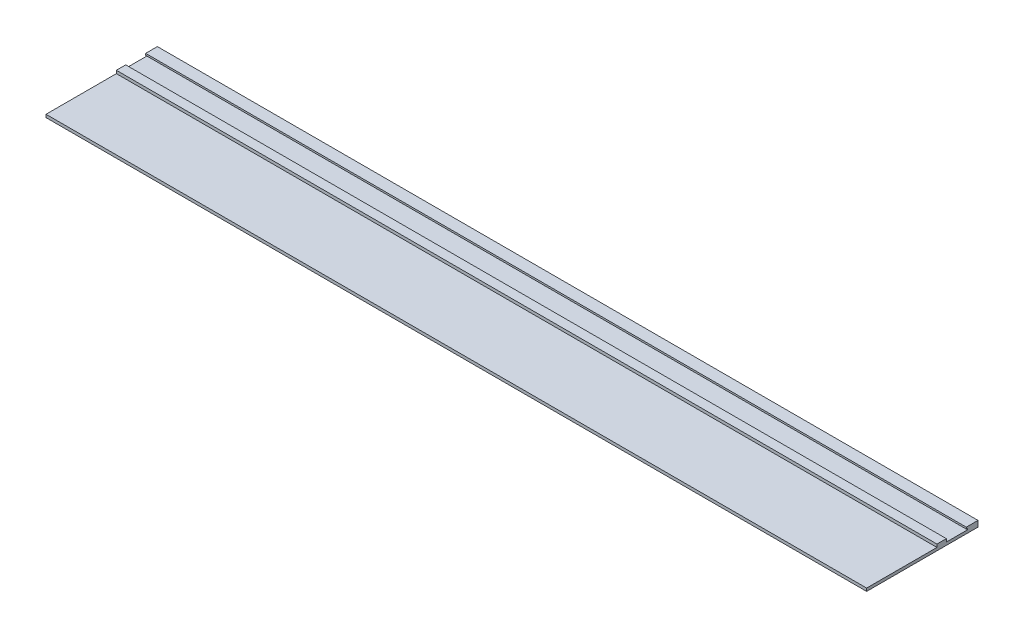
ISO-10303-21;
HEADER;
FILE_DESCRIPTION(('STEP AP214'),'2;1');
FILE_NAME('part.step','',(''),(''),'','','');
FILE_SCHEMA(('AUTOMOTIVE_DESIGN { 1 0 10303 214 1 1 1 1 }'));
ENDSEC;
DATA;
#1=APPLICATION_CONTEXT('core data for automotive mechanical design processes');
#2=APPLICATION_PROTOCOL_DEFINITION('international standard','automotive_design',2000,#1);
#3=PRODUCT_CONTEXT('',#1,'mechanical');
#4=PRODUCT('Part','Part','',(#3));
#5=PRODUCT_RELATED_PRODUCT_CATEGORY('part','',(#4));
#6=PRODUCT_DEFINITION_FORMATION('','',#4);
#7=PRODUCT_DEFINITION_CONTEXT('part definition',#1,'design');
#8=PRODUCT_DEFINITION('design','',#6,#7);
#9=PRODUCT_DEFINITION_SHAPE('','',#8);
#10=(LENGTH_UNIT() NAMED_UNIT(*) SI_UNIT(.MILLI.,.METRE.));
#11=(NAMED_UNIT(*) PLANE_ANGLE_UNIT() SI_UNIT($,.RADIAN.));
#12=(NAMED_UNIT(*) SI_UNIT($,.STERADIAN.) SOLID_ANGLE_UNIT());
#13=UNCERTAINTY_MEASURE_WITH_UNIT(LENGTH_MEASURE(1.E-05),#10,'distance_accuracy_value','');
#14=(GEOMETRIC_REPRESENTATION_CONTEXT(3) GLOBAL_UNCERTAINTY_ASSIGNED_CONTEXT((#13)) GLOBAL_UNIT_ASSIGNED_CONTEXT((#10,
#11,#12)) REPRESENTATION_CONTEXT('',''));
#15=CARTESIAN_POINT('',(0.,0.,0.));
#16=DIRECTION('',(0.,0.,1.));
#17=DIRECTION('',(1.,0.,0.));
#18=AXIS2_PLACEMENT_3D('',#15,#16,#17);
#19=CARTESIAN_POINT('',(1400.,4.98666666666666,0.));
#20=DIRECTION('',(0.,0.,-1.));
#21=DIRECTION('',(-1.,0.,0.));
#22=AXIS2_PLACEMENT_3D('',#19,#20,#21);
#23=PLANE('',#22);
#24=DIRECTION('',(0.,-1.,0.));
#25=VECTOR('',#24,1.);
#26=CARTESIAN_POINT('',(0.,4.98666666666666,0.));
#27=LINE('',#26,#25);
#28=CARTESIAN_POINT('',(0.,4.98666666666666,0.));
#29=VERTEX_POINT('',#28);
#30=CARTESIAN_POINT('',(0.,0.,0.));
#31=VERTEX_POINT('',#30);
#32=EDGE_CURVE('E164',#29,#31,#27,.T.);
#33=ORIENTED_EDGE('',*,*,#32,.T.);
#34=DIRECTION('',(-1.,0.,0.));
#35=VECTOR('',#34,1.);
#36=CARTESIAN_POINT('',(1400.,0.,0.));
#37=LINE('',#36,#35);
#38=CARTESIAN_POINT('',(1400.,0.,0.));
#39=VERTEX_POINT('',#38);
#40=EDGE_CURVE('E11',#39,#31,#37,.T.);
#41=ORIENTED_EDGE('',*,*,#40,.F.);
#42=DIRECTION('',(0.,-1.,0.));
#43=VECTOR('',#42,1.);
#44=CARTESIAN_POINT('',(1400.,4.98666666666666,0.));
#45=LINE('',#44,#43);
#46=CARTESIAN_POINT('',(1400.,4.98666666666666,0.));
#47=VERTEX_POINT('',#46);
#48=EDGE_CURVE('E198',#47,#39,#45,.T.);
#49=ORIENTED_EDGE('',*,*,#48,.F.);
#50=DIRECTION('',(-1.,0.,0.));
#51=VECTOR('',#50,1.);
#52=CARTESIAN_POINT('',(1400.,4.98666666666666,0.));
#53=LINE('',#52,#51);
#54=EDGE_CURVE('E160',#47,#29,#53,.T.);
#55=ORIENTED_EDGE('',*,*,#54,.T.);
#56=EDGE_LOOP('',(#33,#41,#49,#55));
#57=FACE_BOUND('',#56,.T.);
#58=ADVANCED_FACE('F39',(#57),#23,.F.);
#59=CARTESIAN_POINT('',(1400.,0.,0.));
#60=DIRECTION('',(0.,1.,0.));
#61=DIRECTION('',(0.,0.,1.));
#62=AXIS2_PLACEMENT_3D('',#59,#60,#61);
#63=PLANE('',#62);
#64=DIRECTION('',(0.,0.,-1.));
#65=VECTOR('',#64,1.);
#66=CARTESIAN_POINT('',(0.,0.,0.));
#67=LINE('',#66,#65);
#68=CARTESIAN_POINT('',(0.,0.,-190.));
#69=VERTEX_POINT('',#68);
#70=EDGE_CURVE('E168',#31,#69,#67,.T.);
#71=ORIENTED_EDGE('',*,*,#70,.T.);
#72=DIRECTION('',(-1.,0.,0.));
#73=VECTOR('',#72,1.);
#74=CARTESIAN_POINT('',(1400.,0.,-190.));
#75=LINE('',#74,#73);
#76=CARTESIAN_POINT('',(1400.,0.,-190.));
#77=VERTEX_POINT('',#76);
#78=EDGE_CURVE('E48',#77,#69,#75,.T.);
#79=ORIENTED_EDGE('',*,*,#78,.F.);
#80=DIRECTION('',(0.,0.,-1.));
#81=VECTOR('',#80,1.);
#82=CARTESIAN_POINT('',(1400.,0.,0.));
#83=LINE('',#82,#81);
#84=EDGE_CURVE('E111',#39,#77,#83,.T.);
#85=ORIENTED_EDGE('',*,*,#84,.F.);
#86=ORIENTED_EDGE('',*,*,#40,.T.);
#87=EDGE_LOOP('',(#71,#79,#85,#86));
#88=FACE_BOUND('',#87,.T.);
#89=ADVANCED_FACE('F292',(#88),#63,.F.);
#90=CARTESIAN_POINT('',(1400.,0.,-190.));
#91=DIRECTION('',(0.,0.,1.));
#92=DIRECTION('',(1.,0.,0.));
#93=AXIS2_PLACEMENT_3D('',#90,#91,#92);
#94=PLANE('',#93);
#95=DIRECTION('',(0.,1.,0.));
#96=VECTOR('',#95,1.);
#97=CARTESIAN_POINT('',(0.,0.,-190.));
#98=LINE('',#97,#96);
#99=CARTESIAN_POINT('',(0.,10.,-190.));
#100=VERTEX_POINT('',#99);
#101=EDGE_CURVE('E171',#69,#100,#98,.T.);
#102=ORIENTED_EDGE('',*,*,#101,.T.);
#103=DIRECTION('',(-1.,0.,0.));
#104=VECTOR('',#103,1.);
#105=CARTESIAN_POINT('',(1400.,10.,-190.));
#106=LINE('',#105,#104);
#107=CARTESIAN_POINT('',(1400.,10.,-190.));
#108=VERTEX_POINT('',#107);
#109=EDGE_CURVE('E225',#108,#100,#106,.T.);
#110=ORIENTED_EDGE('',*,*,#109,.F.);
#111=DIRECTION('',(0.,1.,0.));
#112=VECTOR('',#111,1.);
#113=CARTESIAN_POINT('',(1400.,0.,-190.));
#114=LINE('',#113,#112);
#115=EDGE_CURVE('E235',#77,#108,#114,.T.);
#116=ORIENTED_EDGE('',*,*,#115,.F.);
#117=ORIENTED_EDGE('',*,*,#78,.T.);
#118=EDGE_LOOP('',(#102,#110,#116,#117));
#119=FACE_BOUND('',#118,.T.);
#120=ADVANCED_FACE('F233',(#119),#94,.F.);
#121=CARTESIAN_POINT('',(1400.,10.,-190.));
#122=DIRECTION('',(0.,-1.,0.));
#123=DIRECTION('',(0.,0.,-1.));
#124=AXIS2_PLACEMENT_3D('',#121,#122,#123);
#125=PLANE('',#124);
#126=DIRECTION('',(0.,0.,1.));
#127=VECTOR('',#126,1.);
#128=CARTESIAN_POINT('',(0.,10.,-190.));
#129=LINE('',#128,#127);
#130=CARTESIAN_POINT('',(0.,10.,-170.));
#131=VERTEX_POINT('',#130);
#132=EDGE_CURVE('E174',#100,#131,#129,.T.);
#133=ORIENTED_EDGE('',*,*,#132,.T.);
#134=DIRECTION('',(-1.,0.,0.));
#135=VECTOR('',#134,1.);
#136=CARTESIAN_POINT('',(1400.,10.,-170.));
#137=LINE('',#136,#135);
#138=CARTESIAN_POINT('',(1400.,10.,-170.));
#139=VERTEX_POINT('',#138);
#140=EDGE_CURVE('E221',#139,#131,#137,.T.);
#141=ORIENTED_EDGE('',*,*,#140,.F.);
#142=DIRECTION('',(0.,0.,1.));
#143=VECTOR('',#142,1.);
#144=CARTESIAN_POINT('',(1400.,10.,-190.));
#145=LINE('',#144,#143);
#146=EDGE_CURVE('E254',#108,#139,#145,.T.);
#147=ORIENTED_EDGE('',*,*,#146,.F.);
#148=ORIENTED_EDGE('',*,*,#109,.T.);
#149=EDGE_LOOP('',(#133,#141,#147,#148));
#150=FACE_BOUND('',#149,.T.);
#151=ADVANCED_FACE('F244',(#150),#125,.F.);
#152=CARTESIAN_POINT('',(1400.,10.,-170.));
#153=DIRECTION('',(0.,0.,-1.));
#154=DIRECTION('',(-1.,0.,0.));
#155=AXIS2_PLACEMENT_3D('',#152,#153,#154);
#156=PLANE('',#155);
#157=DIRECTION('',(0.,-1.,0.));
#158=VECTOR('',#157,1.);
#159=CARTESIAN_POINT('',(0.,10.,-170.));
#160=LINE('',#159,#158);
#161=CARTESIAN_POINT('',(0.,7.12380952380952,-170.));
#162=VERTEX_POINT('',#161);
#163=EDGE_CURVE('E177',#131,#162,#160,.T.);
#164=ORIENTED_EDGE('',*,*,#163,.T.);
#165=DIRECTION('',(-1.,0.,0.));
#166=VECTOR('',#165,1.);
#167=CARTESIAN_POINT('',(1400.,7.12380952380952,-170.));
#168=LINE('',#167,#166);
#169=CARTESIAN_POINT('',(1400.,7.12380952380952,-170.));
#170=VERTEX_POINT('',#169);
#171=EDGE_CURVE('E217',#170,#162,#168,.T.);
#172=ORIENTED_EDGE('',*,*,#171,.F.);
#173=DIRECTION('',(0.,-1.,0.));
#174=VECTOR('',#173,1.);
#175=CARTESIAN_POINT('',(1400.,10.,-170.));
#176=LINE('',#175,#174);
#177=EDGE_CURVE('E250',#139,#170,#176,.T.);
#178=ORIENTED_EDGE('',*,*,#177,.F.);
#179=ORIENTED_EDGE('',*,*,#140,.T.);
#180=EDGE_LOOP('',(#164,#172,#178,#179));
#181=FACE_BOUND('',#180,.T.);
#182=ADVANCED_FACE('F248',(#181),#156,.F.);
#183=CARTESIAN_POINT('',(1400.,7.12380952380952,-170.));
#184=DIRECTION('',(0.,1.,0.));
#185=DIRECTION('',(0.,0.,1.));
#186=AXIS2_PLACEMENT_3D('',#183,#184,#185);
#187=PLANE('',#186);
#188=DIRECTION('',(0.,0.,-1.));
#189=VECTOR('',#188,1.);
#190=CARTESIAN_POINT('',(0.,7.12380952380952,-170.));
#191=LINE('',#190,#189);
#192=CARTESIAN_POINT('',(0.,7.12380952380952,-172.063338750234));
#193=VERTEX_POINT('',#192);
#194=EDGE_CURVE('E180',#162,#193,#191,.T.);
#195=ORIENTED_EDGE('',*,*,#194,.T.);
#196=DIRECTION('',(-1.,0.,0.));
#197=VECTOR('',#196,1.);
#198=CARTESIAN_POINT('',(1400.,7.12380952380952,-172.063338750234));
#199=LINE('',#198,#197);
#200=CARTESIAN_POINT('',(1400.,7.12380952380952,-172.063338750234));
#201=VERTEX_POINT('',#200);
#202=EDGE_CURVE('E213',#201,#193,#199,.T.);
#203=ORIENTED_EDGE('',*,*,#202,.F.);
#204=DIRECTION('',(0.,0.,-1.));
#205=VECTOR('',#204,1.);
#206=CARTESIAN_POINT('',(1400.,7.12380952380952,-170.));
#207=LINE('',#206,#205);
#208=EDGE_CURVE('E253',#170,#201,#207,.T.);
#209=ORIENTED_EDGE('',*,*,#208,.F.);
#210=ORIENTED_EDGE('',*,*,#171,.T.);
#211=EDGE_LOOP('',(#195,#203,#209,#210));
#212=FACE_BOUND('',#211,.T.);
#213=ADVANCED_FACE('F305',(#212),#187,.F.);
#214=CARTESIAN_POINT('',(1400.,7.12380952380952,-172.063338750234));
#215=DIRECTION('',(0.,0.,-1.));
#216=DIRECTION('',(-1.,0.,0.));
#217=AXIS2_PLACEMENT_3D('',#214,#215,#216);
#218=PLANE('',#217);
#219=DIRECTION('',(0.,-1.,0.));
#220=VECTOR('',#219,1.);
#221=CARTESIAN_POINT('',(0.,7.12380952380952,-172.063338750234));
#222=LINE('',#221,#220);
#223=CARTESIAN_POINT('',(0.,4.98666666666665,-172.063338750234));
#224=VERTEX_POINT('',#223);
#225=EDGE_CURVE('E183',#193,#224,#222,.T.);
#226=ORIENTED_EDGE('',*,*,#225,.T.);
#227=DIRECTION('',(-1.,0.,0.));
#228=VECTOR('',#227,1.);
#229=CARTESIAN_POINT('',(1400.,4.98666666666665,-172.063338750234));
#230=LINE('',#229,#228);
#231=CARTESIAN_POINT('',(1400.,4.98666666666665,-172.063338750234));
#232=VERTEX_POINT('',#231);
#233=EDGE_CURVE('E209',#232,#224,#230,.T.);
#234=ORIENTED_EDGE('',*,*,#233,.F.);
#235=DIRECTION('',(0.,-1.,0.));
#236=VECTOR('',#235,1.);
#237=CARTESIAN_POINT('',(1400.,7.12380952380952,-172.063338750234));
#238=LINE('',#237,#236);
#239=EDGE_CURVE('E258',#201,#232,#238,.T.);
#240=ORIENTED_EDGE('',*,*,#239,.F.);
#241=ORIENTED_EDGE('',*,*,#202,.T.);
#242=EDGE_LOOP('',(#226,#234,#240,#241));
#243=FACE_BOUND('',#242,.T.);
#244=ADVANCED_FACE('F308',(#243),#218,.F.);
#245=CARTESIAN_POINT('',(1400.,4.98666666666665,-172.063338750234));
#246=DIRECTION('',(0.,-1.,0.));
#247=DIRECTION('',(0.,0.,-1.));
#248=AXIS2_PLACEMENT_3D('',#245,#246,#247);
#249=PLANE('',#248);
#250=DIRECTION('',(0.,0.,1.));
#251=VECTOR('',#250,1.);
#252=CARTESIAN_POINT('',(0.,4.98666666666665,-172.063338750234));
#253=LINE('',#252,#251);
#254=CARTESIAN_POINT('',(0.,4.98666666666665,-136.));
#255=VERTEX_POINT('',#254);
#256=EDGE_CURVE('E186',#224,#255,#253,.T.);
#257=ORIENTED_EDGE('',*,*,#256,.T.);
#258=DIRECTION('',(-1.,0.,0.));
#259=VECTOR('',#258,1.);
#260=CARTESIAN_POINT('',(1400.,4.98666666666665,-136.));
#261=LINE('',#260,#259);
#262=CARTESIAN_POINT('',(1400.,4.98666666666665,-136.));
#263=VERTEX_POINT('',#262);
#264=EDGE_CURVE('E205',#263,#255,#261,.T.);
#265=ORIENTED_EDGE('',*,*,#264,.F.);
#266=DIRECTION('',(0.,0.,1.));
#267=VECTOR('',#266,1.);
#268=CARTESIAN_POINT('',(1400.,4.98666666666665,-172.063338750234));
#269=LINE('',#268,#267);
#270=EDGE_CURVE('E265',#232,#263,#269,.T.);
#271=ORIENTED_EDGE('',*,*,#270,.F.);
#272=ORIENTED_EDGE('',*,*,#233,.T.);
#273=EDGE_LOOP('',(#257,#265,#271,#272));
#274=FACE_BOUND('',#273,.T.);
#275=ADVANCED_FACE('F273',(#274),#249,.F.);
#276=CARTESIAN_POINT('',(1400.,4.98666666666665,-136.));
#277=DIRECTION('',(0.,0.,1.));
#278=DIRECTION('',(1.,0.,0.));
#279=AXIS2_PLACEMENT_3D('',#276,#277,#278);
#280=PLANE('',#279);
#281=DIRECTION('',(0.,1.,0.));
#282=VECTOR('',#281,1.);
#283=CARTESIAN_POINT('',(0.,4.98666666666665,-136.));
#284=LINE('',#283,#282);
#285=CARTESIAN_POINT('',(0.,10.,-136.));
#286=VERTEX_POINT('',#285);
#287=EDGE_CURVE('E189',#255,#286,#284,.T.);
#288=ORIENTED_EDGE('',*,*,#287,.T.);
#289=DIRECTION('',(-1.,0.,0.));
#290=VECTOR('',#289,1.);
#291=CARTESIAN_POINT('',(1400.,10.,-136.));
#292=LINE('',#291,#290);
#293=CARTESIAN_POINT('',(1400.,10.,-136.));
#294=VERTEX_POINT('',#293);
#295=EDGE_CURVE('E153',#294,#286,#292,.T.);
#296=ORIENTED_EDGE('',*,*,#295,.F.);
#297=DIRECTION('',(0.,1.,0.));
#298=VECTOR('',#297,1.);
#299=CARTESIAN_POINT('',(1400.,4.98666666666665,-136.));
#300=LINE('',#299,#298);
#301=EDGE_CURVE('E142',#263,#294,#300,.T.);
#302=ORIENTED_EDGE('',*,*,#301,.F.);
#303=ORIENTED_EDGE('',*,*,#264,.T.);
#304=EDGE_LOOP('',(#288,#296,#302,#303));
#305=FACE_BOUND('',#304,.T.);
#306=ADVANCED_FACE('F277',(#305),#280,.F.);
#307=CARTESIAN_POINT('',(1400.,10.,-136.));
#308=DIRECTION('',(0.,-1.,0.));
#309=DIRECTION('',(0.,0.,-1.));
#310=AXIS2_PLACEMENT_3D('',#307,#308,#309);
#311=PLANE('',#310);
#312=DIRECTION('',(0.,0.,1.));
#313=VECTOR('',#312,1.);
#314=CARTESIAN_POINT('',(0.,10.,-136.));
#315=LINE('',#314,#313);
#316=CARTESIAN_POINT('',(0.,10.,-120.));
#317=VERTEX_POINT('',#316);
#318=EDGE_CURVE('E151',#286,#317,#315,.T.);
#319=ORIENTED_EDGE('',*,*,#318,.T.);
#320=DIRECTION('',(-1.,0.,0.));
#321=VECTOR('',#320,1.);
#322=CARTESIAN_POINT('',(1400.,10.,-120.));
#323=LINE('',#322,#321);
#324=CARTESIAN_POINT('',(1400.,10.,-120.));
#325=VERTEX_POINT('',#324);
#326=EDGE_CURVE('E148',#325,#317,#323,.T.);
#327=ORIENTED_EDGE('',*,*,#326,.F.);
#328=DIRECTION('',(0.,0.,1.));
#329=VECTOR('',#328,1.);
#330=CARTESIAN_POINT('',(1400.,10.,-136.));
#331=LINE('',#330,#329);
#332=EDGE_CURVE('E136',#294,#325,#331,.T.);
#333=ORIENTED_EDGE('',*,*,#332,.F.);
#334=ORIENTED_EDGE('',*,*,#295,.T.);
#335=EDGE_LOOP('',(#319,#327,#333,#334));
#336=FACE_BOUND('',#335,.T.);
#337=ADVANCED_FACE('F149',(#336),#311,.F.);
#338=CARTESIAN_POINT('',(1400.,10.,-120.));
#339=DIRECTION('',(0.,0.,-1.));
#340=DIRECTION('',(-1.,0.,0.));
#341=AXIS2_PLACEMENT_3D('',#338,#339,#340);
#342=PLANE('',#341);
#343=DIRECTION('',(0.,-1.,0.));
#344=VECTOR('',#343,1.);
#345=CARTESIAN_POINT('',(0.,10.,-120.));
#346=LINE('',#345,#344);
#347=CARTESIAN_POINT('',(0.,4.98666666666667,-120.));
#348=VERTEX_POINT('',#347);
#349=EDGE_CURVE('E97',#317,#348,#346,.T.);
#350=ORIENTED_EDGE('',*,*,#349,.T.);
#351=DIRECTION('',(-1.,0.,0.));
#352=VECTOR('',#351,1.);
#353=CARTESIAN_POINT('',(1400.,4.98666666666667,-120.));
#354=LINE('',#353,#352);
#355=CARTESIAN_POINT('',(1400.,4.98666666666667,-120.));
#356=VERTEX_POINT('',#355);
#357=EDGE_CURVE('E154',#356,#348,#354,.T.);
#358=ORIENTED_EDGE('',*,*,#357,.F.);
#359=DIRECTION('',(0.,-1.,0.));
#360=VECTOR('',#359,1.);
#361=CARTESIAN_POINT('',(1400.,10.,-120.));
#362=LINE('',#361,#360);
#363=EDGE_CURVE('E140',#325,#356,#362,.T.);
#364=ORIENTED_EDGE('',*,*,#363,.F.);
#365=ORIENTED_EDGE('',*,*,#326,.T.);
#366=EDGE_LOOP('',(#350,#358,#364,#365));
#367=FACE_BOUND('',#366,.T.);
#368=ADVANCED_FACE('F156',(#367),#342,.F.);
#369=CARTESIAN_POINT('',(1400.,4.98666666666667,-120.));
#370=DIRECTION('',(0.,-1.,0.));
#371=DIRECTION('',(0.,0.,-1.));
#372=AXIS2_PLACEMENT_3D('',#369,#370,#371);
#373=PLANE('',#372);
#374=DIRECTION('',(0.,0.,1.));
#375=VECTOR('',#374,1.);
#376=CARTESIAN_POINT('',(0.,4.98666666666667,-120.));
#377=LINE('',#376,#375);
#378=EDGE_CURVE('E103',#348,#29,#377,.T.);
#379=ORIENTED_EDGE('',*,*,#378,.T.);
#380=ORIENTED_EDGE('',*,*,#54,.F.);
#381=DIRECTION('',(0.,0.,1.));
#382=VECTOR('',#381,1.);
#383=CARTESIAN_POINT('',(1400.,4.98666666666667,-120.));
#384=LINE('',#383,#382);
#385=EDGE_CURVE('E56',#356,#47,#384,.T.);
#386=ORIENTED_EDGE('',*,*,#385,.F.);
#387=ORIENTED_EDGE('',*,*,#357,.T.);
#388=EDGE_LOOP('',(#379,#380,#386,#387));
#389=FACE_BOUND('',#388,.T.);
#390=ADVANCED_FACE('F281',(#389),#373,.F.);
#391=CARTESIAN_POINT('',(1400.,0.,0.));
#392=DIRECTION('',(1.,0.,0.));
#393=DIRECTION('',(0.,0.,-1.));
#394=AXIS2_PLACEMENT_3D('',#391,#392,#393);
#395=PLANE('',#394);
#396=ORIENTED_EDGE('',*,*,#48,.T.);
#397=ORIENTED_EDGE('',*,*,#84,.T.);
#398=ORIENTED_EDGE('',*,*,#115,.T.);
#399=ORIENTED_EDGE('',*,*,#146,.T.);
#400=ORIENTED_EDGE('',*,*,#177,.T.);
#401=ORIENTED_EDGE('',*,*,#208,.T.);
#402=ORIENTED_EDGE('',*,*,#239,.T.);
#403=ORIENTED_EDGE('',*,*,#270,.T.);
#404=ORIENTED_EDGE('',*,*,#301,.T.);
#405=ORIENTED_EDGE('',*,*,#332,.T.);
#406=ORIENTED_EDGE('',*,*,#363,.T.);
#407=ORIENTED_EDGE('',*,*,#385,.T.);
#408=EDGE_LOOP('',(#396,#397,#398,#399,#400,#401,#402,#403,#404,#405,#406,#407));
#409=FACE_BOUND('',#408,.T.);
#410=ADVANCED_FACE('F138',(#409),#395,.T.);
#411=CARTESIAN_POINT('',(0.,0.,0.));
#412=DIRECTION('',(1.,0.,0.));
#413=DIRECTION('',(0.,0.,-1.));
#414=AXIS2_PLACEMENT_3D('',#411,#412,#413);
#415=PLANE('',#414);
#416=ORIENTED_EDGE('',*,*,#32,.F.);
#417=ORIENTED_EDGE('',*,*,#378,.F.);
#418=ORIENTED_EDGE('',*,*,#349,.F.);
#419=ORIENTED_EDGE('',*,*,#318,.F.);
#420=ORIENTED_EDGE('',*,*,#287,.F.);
#421=ORIENTED_EDGE('',*,*,#256,.F.);
#422=ORIENTED_EDGE('',*,*,#225,.F.);
#423=ORIENTED_EDGE('',*,*,#194,.F.);
#424=ORIENTED_EDGE('',*,*,#163,.F.);
#425=ORIENTED_EDGE('',*,*,#132,.F.);
#426=ORIENTED_EDGE('',*,*,#101,.F.);
#427=ORIENTED_EDGE('',*,*,#70,.F.);
#428=EDGE_LOOP('',(#416,#417,#418,#419,#420,#421,#422,#423,#424,#425,#426,#427));
#429=FACE_BOUND('',#428,.T.);
#430=ADVANCED_FACE('F239',(#429),#415,.F.);
#431=CLOSED_SHELL('',(#58,#89,#120,#151,#182,#213,#244,#275,#306,#337,#368,#390,#410,#430));
#432=MANIFOLD_SOLID_BREP('B2',#431);
#433=ADVANCED_BREP_SHAPE_REPRESENTATION('',(#18,#432),#14);
#434=SHAPE_DEFINITION_REPRESENTATION(#9,#433);
ENDSEC;
END-ISO-10303-21;
